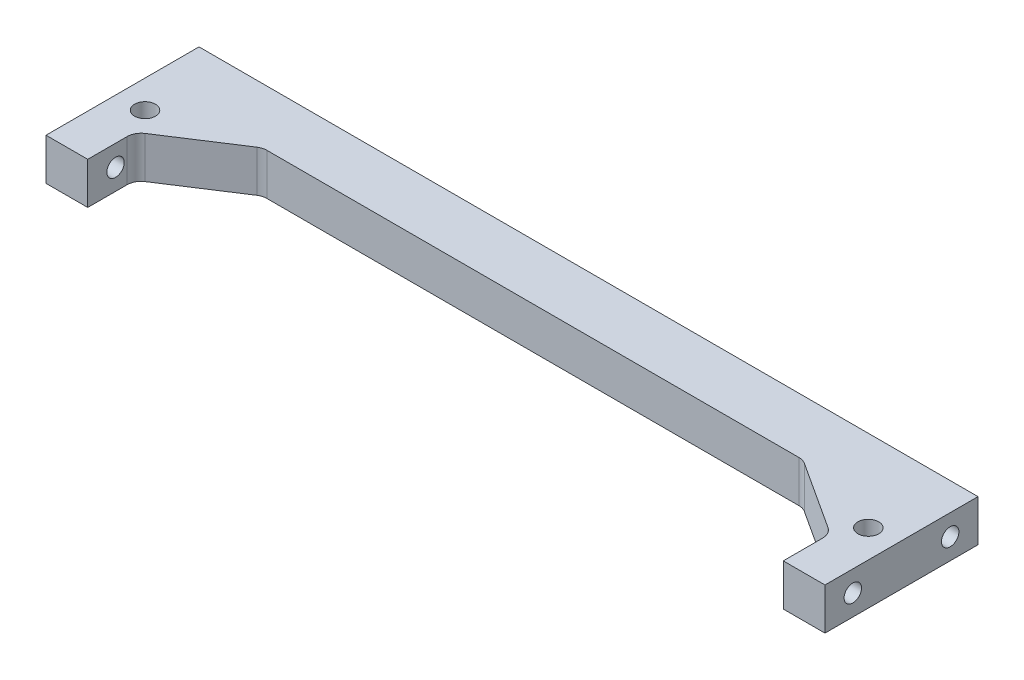
ISO-10303-21;
HEADER;
FILE_DESCRIPTION(('STEP AP214'),'2;1');
FILE_NAME('part.step','',(''),(''),'','','');
FILE_SCHEMA(('AUTOMOTIVE_DESIGN { 1 0 10303 214 1 1 1 1 }'));
ENDSEC;
DATA;
#1=APPLICATION_CONTEXT('core data for automotive mechanical design processes');
#2=APPLICATION_PROTOCOL_DEFINITION('international standard','automotive_design',2000,#1);
#3=PRODUCT_CONTEXT('',#1,'mechanical');
#4=PRODUCT('Part','Part','',(#3));
#5=PRODUCT_RELATED_PRODUCT_CATEGORY('part','',(#4));
#6=PRODUCT_DEFINITION_FORMATION('','',#4);
#7=PRODUCT_DEFINITION_CONTEXT('part definition',#1,'design');
#8=PRODUCT_DEFINITION('design','',#6,#7);
#9=PRODUCT_DEFINITION_SHAPE('','',#8);
#10=(LENGTH_UNIT() NAMED_UNIT(*) SI_UNIT(.MILLI.,.METRE.));
#11=(NAMED_UNIT(*) PLANE_ANGLE_UNIT() SI_UNIT($,.RADIAN.));
#12=(NAMED_UNIT(*) SI_UNIT($,.STERADIAN.) SOLID_ANGLE_UNIT());
#13=UNCERTAINTY_MEASURE_WITH_UNIT(LENGTH_MEASURE(1.E-05),#10,'distance_accuracy_value','');
#14=(GEOMETRIC_REPRESENTATION_CONTEXT(3) GLOBAL_UNCERTAINTY_ASSIGNED_CONTEXT((#13)) GLOBAL_UNIT_ASSIGNED_CONTEXT((#10,
#11,#12)) REPRESENTATION_CONTEXT('',''));
#15=CARTESIAN_POINT('',(0.,0.,0.));
#16=DIRECTION('',(0.,0.,1.));
#17=DIRECTION('',(1.,0.,0.));
#18=AXIS2_PLACEMENT_3D('',#15,#16,#17);
#19=CARTESIAN_POINT('',(0.,6.,0.));
#20=DIRECTION('',(0.,1.,0.));
#21=DIRECTION('',(0.,0.,1.));
#22=AXIS2_PLACEMENT_3D('',#19,#20,#21);
#23=PLANE('',#22);
#24=DIRECTION('',(0.,0.,1.));
#25=VECTOR('',#24,1.);
#26=CARTESIAN_POINT('',(-56.,6.,22.));
#27=LINE('',#26,#25);
#28=CARTESIAN_POINT('',(-56.,6.,22.));
#29=VERTEX_POINT('',#28);
#30=CARTESIAN_POINT('',(-56.,6.,44.));
#31=VERTEX_POINT('',#30);
#32=EDGE_CURVE('E214',#29,#31,#27,.T.);
#33=ORIENTED_EDGE('',*,*,#32,.T.);
#34=DIRECTION('',(1.,0.,0.));
#35=VECTOR('',#34,1.);
#36=CARTESIAN_POINT('',(-56.,6.,44.));
#37=LINE('',#36,#35);
#38=CARTESIAN_POINT('',(-50.,6.,44.));
#39=VERTEX_POINT('',#38);
#40=EDGE_CURVE('E217',#31,#39,#37,.T.);
#41=ORIENTED_EDGE('',*,*,#40,.T.);
#42=DIRECTION('',(0.,0.,-1.));
#43=VECTOR('',#42,1.);
#44=CARTESIAN_POINT('',(-50.,6.,44.));
#45=LINE('',#44,#43);
#46=CARTESIAN_POINT('',(-50.,6.,38.3257442304943));
#47=VERTEX_POINT('',#46);
#48=EDGE_CURVE('E220',#39,#47,#45,.T.);
#49=ORIENTED_EDGE('',*,*,#48,.T.);
#50=CARTESIAN_POINT('',(-48.,6.,38.3257442304943));
#51=DIRECTION('',(0.,1.,0.));
#52=DIRECTION('',(0.,0.,1.));
#53=AXIS2_PLACEMENT_3D('',#50,#51,#52);
#54=CIRCLE('',#53,2.);
#55=CARTESIAN_POINT('',(-49.08927807003,6.,36.6484030946034));
#56=VERTEX_POINT('',#55);
#57=EDGE_CURVE('E264',#47,#56,#54,.F.);
#58=ORIENTED_EDGE('',*,*,#57,.T.);
#59=DIRECTION('',(0.838670567945438,0.,-0.544639035015005));
#60=VECTOR('',#59,1.);
#61=CARTESIAN_POINT('',(-50.,6.,37.2398328312174));
#62=LINE('',#61,#60);
#63=CARTESIAN_POINT('',(-39.348486159439,6.,30.3226588641091));
#64=VERTEX_POINT('',#63);
#65=EDGE_CURVE('E223',#56,#64,#62,.T.);
#66=ORIENTED_EDGE('',*,*,#65,.T.);
#67=CARTESIAN_POINT('',(-38.259208089409,6.,32.));
#68=DIRECTION('',(0.,1.,0.));
#69=DIRECTION('',(0.,0.,1.));
#70=AXIS2_PLACEMENT_3D('',#67,#68,#69);
#71=CIRCLE('',#70,2.);
#72=CARTESIAN_POINT('',(-38.259208089409,6.,30.));
#73=VERTEX_POINT('',#72);
#74=EDGE_CURVE('E268',#64,#73,#71,.F.);
#75=ORIENTED_EDGE('',*,*,#74,.T.);
#76=DIRECTION('',(1.,0.,0.));
#77=VECTOR('',#76,1.);
#78=CARTESIAN_POINT('',(0.,6.,30.));
#79=LINE('',#78,#77);
#80=CARTESIAN_POINT('',(38.259208089409,6.,30.));
#81=VERTEX_POINT('',#80);
#82=EDGE_CURVE('E226',#73,#81,#79,.T.);
#83=ORIENTED_EDGE('',*,*,#82,.T.);
#84=CARTESIAN_POINT('',(38.259208089409,6.,32.));
#85=DIRECTION('',(0.,1.,0.));
#86=DIRECTION('',(0.,0.,1.));
#87=AXIS2_PLACEMENT_3D('',#84,#85,#86);
#88=CIRCLE('',#87,2.);
#89=CARTESIAN_POINT('',(39.348486159439,6.,30.3226588641091));
#90=VERTEX_POINT('',#89);
#91=EDGE_CURVE('E11',#81,#90,#88,.F.);
#92=ORIENTED_EDGE('',*,*,#91,.T.);
#93=DIRECTION('',(-0.838670567945438,0.,-0.544639035015005));
#94=VECTOR('',#93,1.);
#95=CARTESIAN_POINT('',(50.,6.,37.2398328312174));
#96=LINE('',#95,#94);
#97=CARTESIAN_POINT('',(49.08927807003,6.,36.6484030946034));
#98=VERTEX_POINT('',#97);
#99=EDGE_CURVE('E169',#98,#90,#96,.T.);
#100=ORIENTED_EDGE('',*,*,#99,.F.);
#101=CARTESIAN_POINT('',(48.,6.,38.3257442304943));
#102=DIRECTION('',(0.,1.,0.));
#103=DIRECTION('',(0.,0.,1.));
#104=AXIS2_PLACEMENT_3D('',#101,#102,#103);
#105=CIRCLE('',#104,2.);
#106=CARTESIAN_POINT('',(50.,6.,38.3257442304943));
#107=VERTEX_POINT('',#106);
#108=EDGE_CURVE('E281',#98,#107,#105,.F.);
#109=ORIENTED_EDGE('',*,*,#108,.T.);
#110=DIRECTION('',(0.,0.,-1.));
#111=VECTOR('',#110,1.);
#112=CARTESIAN_POINT('',(50.,6.,44.));
#113=LINE('',#112,#111);
#114=CARTESIAN_POINT('',(50.,6.,44.));
#115=VERTEX_POINT('',#114);
#116=EDGE_CURVE('E173',#115,#107,#113,.T.);
#117=ORIENTED_EDGE('',*,*,#116,.F.);
#118=DIRECTION('',(-1.,0.,0.));
#119=VECTOR('',#118,1.);
#120=CARTESIAN_POINT('',(56.,6.,44.));
#121=LINE('',#120,#119);
#122=CARTESIAN_POINT('',(56.,6.,44.));
#123=VERTEX_POINT('',#122);
#124=EDGE_CURVE('E176',#123,#115,#121,.T.);
#125=ORIENTED_EDGE('',*,*,#124,.F.);
#126=DIRECTION('',(0.,0.,1.));
#127=VECTOR('',#126,1.);
#128=CARTESIAN_POINT('',(56.,6.,22.));
#129=LINE('',#128,#127);
#130=CARTESIAN_POINT('',(56.,6.,22.));
#131=VERTEX_POINT('',#130);
#132=EDGE_CURVE('E166',#131,#123,#129,.T.);
#133=ORIENTED_EDGE('',*,*,#132,.F.);
#134=DIRECTION('',(-1.,0.,0.));
#135=VECTOR('',#134,1.);
#136=CARTESIAN_POINT('',(0.,6.,22.));
#137=LINE('',#136,#135);
#138=EDGE_CURVE('E228',#131,#29,#137,.T.);
#139=ORIENTED_EDGE('',*,*,#138,.T.);
#140=EDGE_LOOP('',(#33,#41,#49,#58,#66,#75,#83,#92,#100,#109,#117,#125,#133,#139));
#141=FACE_BOUND('',#140,.T.);
#142=CARTESIAN_POINT('',(-51.9975752126172,6.,33.7676201709303));
#143=DIRECTION('',(0.,1.,0.));
#144=DIRECTION('',(0.,0.,1.));
#145=AXIS2_PLACEMENT_3D('',#142,#143,#144);
#146=CIRCLE('',#145,1.50000000000035);
#147=CARTESIAN_POINT('',(-51.9975752126172,6.,35.2676201709307));
#148=VERTEX_POINT('',#147);
#149=EDGE_CURVE('E208',#148,#148,#146,.T.);
#150=ORIENTED_EDGE('',*,*,#149,.F.);
#151=EDGE_LOOP('',(#150));
#152=FACE_BOUND('',#151,.T.);
#153=CARTESIAN_POINT('',(51.9975752126172,6.,33.7676201709303));
#154=DIRECTION('',(0.,-1.,0.));
#155=DIRECTION('',(0.,0.,1.));
#156=AXIS2_PLACEMENT_3D('',#153,#154,#155);
#157=CIRCLE('',#156,1.50000000000035);
#158=CARTESIAN_POINT('',(51.9975752126172,6.,35.2676201709307));
#159=VERTEX_POINT('',#158);
#160=EDGE_CURVE('E160',#159,#159,#157,.T.);
#161=ORIENTED_EDGE('',*,*,#160,.T.);
#162=EDGE_LOOP('',(#161));
#163=FACE_BOUND('',#162,.T.);
#164=ADVANCED_FACE('F33',(#141,#152,#163),#23,.T.);
#165=CARTESIAN_POINT('',(0.,0.,0.));
#166=DIRECTION('',(0.,1.,0.));
#167=DIRECTION('',(0.,0.,1.));
#168=AXIS2_PLACEMENT_3D('',#165,#166,#167);
#169=PLANE('',#168);
#170=DIRECTION('',(0.,0.,1.));
#171=VECTOR('',#170,1.);
#172=CARTESIAN_POINT('',(-56.,0.,22.));
#173=LINE('',#172,#171);
#174=CARTESIAN_POINT('',(-56.,0.,22.));
#175=VERTEX_POINT('',#174);
#176=CARTESIAN_POINT('',(-56.,0.,44.));
#177=VERTEX_POINT('',#176);
#178=EDGE_CURVE('E211',#175,#177,#173,.T.);
#179=ORIENTED_EDGE('',*,*,#178,.F.);
#180=DIRECTION('',(-1.,0.,0.));
#181=VECTOR('',#180,1.);
#182=CARTESIAN_POINT('',(0.,0.,22.));
#183=LINE('',#182,#181);
#184=CARTESIAN_POINT('',(56.,0.,22.));
#185=VERTEX_POINT('',#184);
#186=EDGE_CURVE('E218',#185,#175,#183,.T.);
#187=ORIENTED_EDGE('',*,*,#186,.F.);
#188=DIRECTION('',(0.,0.,1.));
#189=VECTOR('',#188,1.);
#190=CARTESIAN_POINT('',(56.,0.,22.));
#191=LINE('',#190,#189);
#192=CARTESIAN_POINT('',(56.,0.,44.));
#193=VERTEX_POINT('',#192);
#194=EDGE_CURVE('E163',#185,#193,#191,.T.);
#195=ORIENTED_EDGE('',*,*,#194,.T.);
#196=DIRECTION('',(-1.,0.,0.));
#197=VECTOR('',#196,1.);
#198=CARTESIAN_POINT('',(56.,0.,44.));
#199=LINE('',#198,#197);
#200=CARTESIAN_POINT('',(50.,0.,44.));
#201=VERTEX_POINT('',#200);
#202=EDGE_CURVE('E170',#193,#201,#199,.T.);
#203=ORIENTED_EDGE('',*,*,#202,.T.);
#204=DIRECTION('',(0.,0.,-1.));
#205=VECTOR('',#204,1.);
#206=CARTESIAN_POINT('',(50.,0.,44.));
#207=LINE('',#206,#205);
#208=CARTESIAN_POINT('',(50.,0.,38.3257442304943));
#209=VERTEX_POINT('',#208);
#210=EDGE_CURVE('E184',#201,#209,#207,.T.);
#211=ORIENTED_EDGE('',*,*,#210,.T.);
#212=CARTESIAN_POINT('',(48.,0.,38.3257442304943));
#213=DIRECTION('',(0.,1.,0.));
#214=DIRECTION('',(0.,0.,1.));
#215=AXIS2_PLACEMENT_3D('',#212,#213,#214);
#216=CIRCLE('',#215,2.);
#217=CARTESIAN_POINT('',(49.08927807003,0.,36.6484030946034));
#218=VERTEX_POINT('',#217);
#219=EDGE_CURVE('E279',#209,#218,#216,.T.);
#220=ORIENTED_EDGE('',*,*,#219,.T.);
#221=DIRECTION('',(-0.838670567945438,0.,-0.544639035015005));
#222=VECTOR('',#221,1.);
#223=CARTESIAN_POINT('',(50.,0.,37.2398328312174));
#224=LINE('',#223,#222);
#225=CARTESIAN_POINT('',(39.348486159439,0.,30.3226588641091));
#226=VERTEX_POINT('',#225);
#227=EDGE_CURVE('E182',#218,#226,#224,.T.);
#228=ORIENTED_EDGE('',*,*,#227,.T.);
#229=CARTESIAN_POINT('',(38.259208089409,0.,32.));
#230=DIRECTION('',(0.,1.,0.));
#231=DIRECTION('',(0.,0.,1.));
#232=AXIS2_PLACEMENT_3D('',#229,#230,#231);
#233=CIRCLE('',#232,2.);
#234=CARTESIAN_POINT('',(38.259208089409,0.,30.));
#235=VERTEX_POINT('',#234);
#236=EDGE_CURVE('E41',#226,#235,#233,.T.);
#237=ORIENTED_EDGE('',*,*,#236,.T.);
#238=DIRECTION('',(1.,0.,0.));
#239=VECTOR('',#238,1.);
#240=CARTESIAN_POINT('',(0.,0.,30.));
#241=LINE('',#240,#239);
#242=CARTESIAN_POINT('',(-38.259208089409,0.,30.));
#243=VERTEX_POINT('',#242);
#244=EDGE_CURVE('E241',#243,#235,#241,.T.);
#245=ORIENTED_EDGE('',*,*,#244,.F.);
#246=CARTESIAN_POINT('',(-38.259208089409,0.,32.));
#247=DIRECTION('',(0.,1.,0.));
#248=DIRECTION('',(0.,0.,1.));
#249=AXIS2_PLACEMENT_3D('',#246,#247,#248);
#250=CIRCLE('',#249,2.);
#251=CARTESIAN_POINT('',(-39.348486159439,0.,30.3226588641091));
#252=VERTEX_POINT('',#251);
#253=EDGE_CURVE('E266',#243,#252,#250,.T.);
#254=ORIENTED_EDGE('',*,*,#253,.T.);
#255=DIRECTION('',(0.838670567945438,0.,-0.544639035015005));
#256=VECTOR('',#255,1.);
#257=CARTESIAN_POINT('',(-50.,0.,37.2398328312174));
#258=LINE('',#257,#256);
#259=CARTESIAN_POINT('',(-49.08927807003,0.,36.6484030946034));
#260=VERTEX_POINT('',#259);
#261=EDGE_CURVE('E238',#260,#252,#258,.T.);
#262=ORIENTED_EDGE('',*,*,#261,.F.);
#263=CARTESIAN_POINT('',(-48.,0.,38.3257442304943));
#264=DIRECTION('',(0.,1.,0.));
#265=DIRECTION('',(0.,0.,1.));
#266=AXIS2_PLACEMENT_3D('',#263,#264,#265);
#267=CIRCLE('',#266,2.);
#268=CARTESIAN_POINT('',(-50.,0.,38.3257442304943));
#269=VERTEX_POINT('',#268);
#270=EDGE_CURVE('E262',#260,#269,#267,.T.);
#271=ORIENTED_EDGE('',*,*,#270,.T.);
#272=DIRECTION('',(0.,0.,-1.));
#273=VECTOR('',#272,1.);
#274=CARTESIAN_POINT('',(-50.,0.,44.));
#275=LINE('',#274,#273);
#276=CARTESIAN_POINT('',(-50.,0.,44.));
#277=VERTEX_POINT('',#276);
#278=EDGE_CURVE('E235',#277,#269,#275,.T.);
#279=ORIENTED_EDGE('',*,*,#278,.F.);
#280=DIRECTION('',(1.,0.,0.));
#281=VECTOR('',#280,1.);
#282=CARTESIAN_POINT('',(-56.,0.,44.));
#283=LINE('',#282,#281);
#284=EDGE_CURVE('E233',#177,#277,#283,.T.);
#285=ORIENTED_EDGE('',*,*,#284,.F.);
#286=EDGE_LOOP('',(#179,#187,#195,#203,#211,#220,#228,#237,#245,#254,#262,#271,#279,#285));
#287=FACE_BOUND('',#286,.T.);
#288=CARTESIAN_POINT('',(-51.9975752126172,0.,33.7676201709303));
#289=DIRECTION('',(0.,1.,0.));
#290=DIRECTION('',(0.,0.,1.));
#291=AXIS2_PLACEMENT_3D('',#288,#289,#290);
#292=CIRCLE('',#291,1.50000000000035);
#293=CARTESIAN_POINT('',(-51.9975752126172,0.,35.2676201709307));
#294=VERTEX_POINT('',#293);
#295=EDGE_CURVE('E207',#294,#294,#292,.T.);
#296=ORIENTED_EDGE('',*,*,#295,.T.);
#297=EDGE_LOOP('',(#296));
#298=FACE_BOUND('',#297,.T.);
#299=CARTESIAN_POINT('',(51.9975752126172,0.,33.7676201709303));
#300=DIRECTION('',(0.,-1.,0.));
#301=DIRECTION('',(0.,0.,1.));
#302=AXIS2_PLACEMENT_3D('',#299,#300,#301);
#303=CIRCLE('',#302,1.50000000000035);
#304=CARTESIAN_POINT('',(51.9975752126172,0.,35.2676201709307));
#305=VERTEX_POINT('',#304);
#306=EDGE_CURVE('E159',#305,#305,#303,.T.);
#307=ORIENTED_EDGE('',*,*,#306,.F.);
#308=EDGE_LOOP('',(#307));
#309=FACE_BOUND('',#308,.T.);
#310=ADVANCED_FACE('F297',(#287,#298,#309),#169,.F.);
#311=CARTESIAN_POINT('',(-56.,6.,22.));
#312=DIRECTION('',(1.,0.,0.));
#313=DIRECTION('',(0.,0.,-1.));
#314=AXIS2_PLACEMENT_3D('',#311,#312,#313);
#315=PLANE('',#314);
#316=CARTESIAN_POINT('',(-56.,3.,26.));
#317=DIRECTION('',(-1.,0.,0.));
#318=DIRECTION('',(0.,0.,1.));
#319=AXIS2_PLACEMENT_3D('',#316,#317,#318);
#320=CIRCLE('',#319,1.24999999999999);
#321=CARTESIAN_POINT('',(-56.,3.,27.25));
#322=VERTEX_POINT('',#321);
#323=EDGE_CURVE('E195',#322,#322,#320,.T.);
#324=ORIENTED_EDGE('',*,*,#323,.F.);
#325=EDGE_LOOP('',(#324));
#326=FACE_BOUND('',#325,.T.);
#327=CARTESIAN_POINT('',(-56.,3.,40.));
#328=DIRECTION('',(-1.,0.,0.));
#329=DIRECTION('',(0.,0.,1.));
#330=AXIS2_PLACEMENT_3D('',#327,#328,#329);
#331=CIRCLE('',#330,1.24999999999999);
#332=CARTESIAN_POINT('',(-56.,3.,41.25));
#333=VERTEX_POINT('',#332);
#334=EDGE_CURVE('E201',#333,#333,#331,.T.);
#335=ORIENTED_EDGE('',*,*,#334,.F.);
#336=EDGE_LOOP('',(#335));
#337=FACE_BOUND('',#336,.T.);
#338=ORIENTED_EDGE('',*,*,#178,.T.);
#339=DIRECTION('',(0.,-1.,0.));
#340=VECTOR('',#339,1.);
#341=CARTESIAN_POINT('',(-56.,6.,44.));
#342=LINE('',#341,#340);
#343=EDGE_CURVE('E249',#31,#177,#342,.T.);
#344=ORIENTED_EDGE('',*,*,#343,.F.);
#345=ORIENTED_EDGE('',*,*,#32,.F.);
#346=DIRECTION('',(0.,-1.,0.));
#347=VECTOR('',#346,1.);
#348=CARTESIAN_POINT('',(-56.,6.,22.));
#349=LINE('',#348,#347);
#350=EDGE_CURVE('E230',#29,#175,#349,.T.);
#351=ORIENTED_EDGE('',*,*,#350,.T.);
#352=EDGE_LOOP('',(#338,#344,#345,#351));
#353=FACE_BOUND('',#352,.T.);
#354=ADVANCED_FACE('F328',(#326,#337,#353),#315,.F.);
#355=CARTESIAN_POINT('',(-56.,6.,44.));
#356=DIRECTION('',(0.,0.,-1.));
#357=DIRECTION('',(-1.,0.,0.));
#358=AXIS2_PLACEMENT_3D('',#355,#356,#357);
#359=PLANE('',#358);
#360=ORIENTED_EDGE('',*,*,#284,.T.);
#361=DIRECTION('',(0.,-1.,0.));
#362=VECTOR('',#361,1.);
#363=CARTESIAN_POINT('',(-50.,6.,44.));
#364=LINE('',#363,#362);
#365=EDGE_CURVE('E246',#39,#277,#364,.T.);
#366=ORIENTED_EDGE('',*,*,#365,.F.);
#367=ORIENTED_EDGE('',*,*,#40,.F.);
#368=ORIENTED_EDGE('',*,*,#343,.T.);
#369=EDGE_LOOP('',(#360,#366,#367,#368));
#370=FACE_BOUND('',#369,.T.);
#371=ADVANCED_FACE('F325',(#370),#359,.F.);
#372=CARTESIAN_POINT('',(-50.,6.,44.));
#373=DIRECTION('',(-1.,0.,0.));
#374=DIRECTION('',(0.,0.,1.));
#375=AXIS2_PLACEMENT_3D('',#372,#373,#374);
#376=PLANE('',#375);
#377=CARTESIAN_POINT('',(-50.,3.,40.));
#378=DIRECTION('',(-1.,0.,0.));
#379=DIRECTION('',(0.,0.,1.));
#380=AXIS2_PLACEMENT_3D('',#377,#378,#379);
#381=CIRCLE('',#380,1.24999999999999);
#382=CARTESIAN_POINT('',(-50.,3.,41.25));
#383=VERTEX_POINT('',#382);
#384=EDGE_CURVE('E204',#383,#383,#381,.T.);
#385=ORIENTED_EDGE('',*,*,#384,.T.);
#386=EDGE_LOOP('',(#385));
#387=FACE_BOUND('',#386,.T.);
#388=ORIENTED_EDGE('',*,*,#278,.T.);
#389=DIRECTION('',(0.,-1.,0.));
#390=VECTOR('',#389,1.);
#391=CARTESIAN_POINT('',(-50.,6.,38.3257442304943));
#392=LINE('',#391,#390);
#393=EDGE_CURVE('E257',#269,#47,#392,.F.);
#394=ORIENTED_EDGE('',*,*,#393,.T.);
#395=ORIENTED_EDGE('',*,*,#48,.F.);
#396=ORIENTED_EDGE('',*,*,#365,.T.);
#397=EDGE_LOOP('',(#388,#394,#395,#396));
#398=FACE_BOUND('',#397,.T.);
#399=ADVANCED_FACE('F321',(#387,#398),#376,.F.);
#400=CARTESIAN_POINT('',(-50.,6.,37.2398328312174));
#401=DIRECTION('',(-0.544639035015005,0.,-0.838670567945438));
#402=DIRECTION('',(-0.838670567945438,0.,0.544639035015005));
#403=AXIS2_PLACEMENT_3D('',#400,#401,#402);
#404=PLANE('',#403);
#405=ORIENTED_EDGE('',*,*,#65,.F.);
#406=DIRECTION('',(0.,-1.,0.));
#407=VECTOR('',#406,1.);
#408=CARTESIAN_POINT('',(-49.08927807003,0.,36.6484030946034));
#409=LINE('',#408,#407);
#410=EDGE_CURVE('E254',#56,#260,#409,.T.);
#411=ORIENTED_EDGE('',*,*,#410,.T.);
#412=ORIENTED_EDGE('',*,*,#261,.T.);
#413=DIRECTION('',(0.,-1.,0.));
#414=VECTOR('',#413,1.);
#415=CARTESIAN_POINT('',(-39.348486159439,6.,30.3226588641091));
#416=LINE('',#415,#414);
#417=EDGE_CURVE('E252',#252,#64,#416,.F.);
#418=ORIENTED_EDGE('',*,*,#417,.T.);
#419=EDGE_LOOP('',(#405,#411,#412,#418));
#420=FACE_BOUND('',#419,.T.);
#421=ADVANCED_FACE('F313',(#420),#404,.F.);
#422=CARTESIAN_POINT('',(0.,6.,30.));
#423=DIRECTION('',(0.,0.,-1.));
#424=DIRECTION('',(-1.,0.,0.));
#425=AXIS2_PLACEMENT_3D('',#422,#423,#424);
#426=PLANE('',#425);
#427=ORIENTED_EDGE('',*,*,#244,.T.);
#428=DIRECTION('',(0.,-1.,0.));
#429=VECTOR('',#428,1.);
#430=CARTESIAN_POINT('',(38.259208089409,6.,30.));
#431=LINE('',#430,#429);
#432=EDGE_CURVE('E54',#235,#81,#431,.F.);
#433=ORIENTED_EDGE('',*,*,#432,.T.);
#434=ORIENTED_EDGE('',*,*,#82,.F.);
#435=DIRECTION('',(0.,-1.,0.));
#436=VECTOR('',#435,1.);
#437=CARTESIAN_POINT('',(-38.259208089409,0.,30.));
#438=LINE('',#437,#436);
#439=EDGE_CURVE('E259',#73,#243,#438,.T.);
#440=ORIENTED_EDGE('',*,*,#439,.T.);
#441=EDGE_LOOP('',(#427,#433,#434,#440));
#442=FACE_BOUND('',#441,.T.);
#443=ADVANCED_FACE('F306',(#442),#426,.F.);
#444=CARTESIAN_POINT('',(0.,6.,22.));
#445=DIRECTION('',(0.,0.,1.));
#446=DIRECTION('',(1.,0.,0.));
#447=AXIS2_PLACEMENT_3D('',#444,#445,#446);
#448=PLANE('',#447);
#449=ORIENTED_EDGE('',*,*,#186,.T.);
#450=ORIENTED_EDGE('',*,*,#350,.F.);
#451=ORIENTED_EDGE('',*,*,#138,.F.);
#452=DIRECTION('',(0.,-1.,0.));
#453=VECTOR('',#452,1.);
#454=CARTESIAN_POINT('',(56.,6.,22.));
#455=LINE('',#454,#453);
#456=EDGE_CURVE('E192',#131,#185,#455,.T.);
#457=ORIENTED_EDGE('',*,*,#456,.T.);
#458=EDGE_LOOP('',(#449,#450,#451,#457));
#459=FACE_BOUND('',#458,.T.);
#460=ADVANCED_FACE('F332',(#459),#448,.F.);
#461=CARTESIAN_POINT('',(-51.9975752126172,6.,33.7676201709303));
#462=DIRECTION('',(0.,-1.,0.));
#463=DIRECTION('',(0.,0.,-1.));
#464=AXIS2_PLACEMENT_3D('',#461,#462,#463);
#465=CYLINDRICAL_SURFACE('',#464,1.50000000000035);
#466=ORIENTED_EDGE('',*,*,#149,.T.);
#467=EDGE_LOOP('',(#466));
#468=FACE_BOUND('',#467,.T.);
#469=ORIENTED_EDGE('',*,*,#295,.F.);
#470=EDGE_LOOP('',(#469));
#471=FACE_BOUND('',#470,.T.);
#472=ADVANCED_FACE('F359',(#468,#471),#465,.F.);
#473=CARTESIAN_POINT('',(-48.,6.,38.3257442304943));
#474=DIRECTION('',(0.,1.,0.));
#475=DIRECTION('',(0.,0.,1.));
#476=AXIS2_PLACEMENT_3D('',#473,#474,#475);
#477=CYLINDRICAL_SURFACE('',#476,2.);
#478=ORIENTED_EDGE('',*,*,#57,.F.);
#479=ORIENTED_EDGE('',*,*,#393,.F.);
#480=ORIENTED_EDGE('',*,*,#270,.F.);
#481=ORIENTED_EDGE('',*,*,#410,.F.);
#482=EDGE_LOOP('',(#478,#479,#480,#481));
#483=FACE_BOUND('',#482,.T.);
#484=ADVANCED_FACE('F317',(#483),#477,.F.);
#485=CARTESIAN_POINT('',(-38.259208089409,6.,32.));
#486=DIRECTION('',(0.,1.,0.));
#487=DIRECTION('',(0.,0.,1.));
#488=AXIS2_PLACEMENT_3D('',#485,#486,#487);
#489=CYLINDRICAL_SURFACE('',#488,2.);
#490=ORIENTED_EDGE('',*,*,#74,.F.);
#491=ORIENTED_EDGE('',*,*,#417,.F.);
#492=ORIENTED_EDGE('',*,*,#253,.F.);
#493=ORIENTED_EDGE('',*,*,#439,.F.);
#494=EDGE_LOOP('',(#490,#491,#492,#493));
#495=FACE_BOUND('',#494,.T.);
#496=ADVANCED_FACE('F308',(#495),#489,.F.);
#497=CARTESIAN_POINT('',(-56.,3.,40.));
#498=DIRECTION('',(-1.,0.,0.));
#499=DIRECTION('',(0.,0.,1.));
#500=AXIS2_PLACEMENT_3D('',#497,#498,#499);
#501=CYLINDRICAL_SURFACE('',#500,1.24999999999999);
#502=ORIENTED_EDGE('',*,*,#334,.T.);
#503=EDGE_LOOP('',(#502));
#504=FACE_BOUND('',#503,.T.);
#505=ORIENTED_EDGE('',*,*,#384,.F.);
#506=EDGE_LOOP('',(#505));
#507=FACE_BOUND('',#506,.T.);
#508=ADVANCED_FACE('F379',(#504,#507),#501,.F.);
#509=CARTESIAN_POINT('',(-46.,3.,26.));
#510=DIRECTION('',(-1.,0.,0.));
#511=DIRECTION('',(0.,0.,1.));
#512=AXIS2_PLACEMENT_3D('',#509,#510,#511);
#513=CONICAL_SURFACE('',#512,1.24999999999999,1.02974425867665);
#514=CARTESIAN_POINT('',(-45.2489242262155,3.,26.));
#515=VERTEX_POINT('',#514);
#516=VERTEX_LOOP('',#515);
#517=FACE_BOUND('',#516,.T.);
#518=CARTESIAN_POINT('',(-46.,3.,26.));
#519=DIRECTION('',(-1.,0.,0.));
#520=DIRECTION('',(0.,0.,1.));
#521=AXIS2_PLACEMENT_3D('',#518,#519,#520);
#522=CIRCLE('',#521,1.24999999999999);
#523=CARTESIAN_POINT('',(-46.,3.,27.25));
#524=VERTEX_POINT('',#523);
#525=EDGE_CURVE('E198',#524,#524,#522,.T.);
#526=ORIENTED_EDGE('',*,*,#525,.T.);
#527=EDGE_LOOP('',(#526));
#528=FACE_BOUND('',#527,.T.);
#529=ADVANCED_FACE('F409',(#517,#528),#513,.F.);
#530=CARTESIAN_POINT('',(-56.,3.,26.));
#531=DIRECTION('',(-1.,0.,0.));
#532=DIRECTION('',(0.,0.,1.));
#533=AXIS2_PLACEMENT_3D('',#530,#531,#532);
#534=CYLINDRICAL_SURFACE('',#533,1.24999999999999);
#535=ORIENTED_EDGE('',*,*,#525,.F.);
#536=EDGE_LOOP('',(#535));
#537=FACE_BOUND('',#536,.T.);
#538=ORIENTED_EDGE('',*,*,#323,.T.);
#539=EDGE_LOOP('',(#538));
#540=FACE_BOUND('',#539,.T.);
#541=ADVANCED_FACE('F401',(#537,#540),#534,.F.);
#542=CARTESIAN_POINT('',(56.,6.,22.));
#543=DIRECTION('',(1.,0.,0.));
#544=DIRECTION('',(0.,0.,-1.));
#545=AXIS2_PLACEMENT_3D('',#542,#543,#544);
#546=PLANE('',#545);
#547=CARTESIAN_POINT('',(56.,3.,26.));
#548=DIRECTION('',(1.,0.,0.));
#549=DIRECTION('',(0.,0.,-1.));
#550=AXIS2_PLACEMENT_3D('',#547,#548,#549);
#551=CIRCLE('',#550,1.24999999999999);
#552=CARTESIAN_POINT('',(56.,3.,24.75));
#553=VERTEX_POINT('',#552);
#554=EDGE_CURVE('E149',#553,#553,#551,.T.);
#555=ORIENTED_EDGE('',*,*,#554,.F.);
#556=EDGE_LOOP('',(#555));
#557=FACE_BOUND('',#556,.T.);
#558=CARTESIAN_POINT('',(56.,3.,40.));
#559=DIRECTION('',(1.,0.,0.));
#560=DIRECTION('',(0.,0.,-1.));
#561=AXIS2_PLACEMENT_3D('',#558,#559,#560);
#562=CIRCLE('',#561,1.24999999999999);
#563=CARTESIAN_POINT('',(56.,3.,38.75));
#564=VERTEX_POINT('',#563);
#565=EDGE_CURVE('E148',#564,#564,#562,.T.);
#566=ORIENTED_EDGE('',*,*,#565,.F.);
#567=EDGE_LOOP('',(#566));
#568=FACE_BOUND('',#567,.T.);
#569=ORIENTED_EDGE('',*,*,#194,.F.);
#570=ORIENTED_EDGE('',*,*,#456,.F.);
#571=ORIENTED_EDGE('',*,*,#132,.T.);
#572=DIRECTION('',(0.,-1.,0.));
#573=VECTOR('',#572,1.);
#574=CARTESIAN_POINT('',(56.,6.,44.));
#575=LINE('',#574,#573);
#576=EDGE_CURVE('E179',#123,#193,#575,.T.);
#577=ORIENTED_EDGE('',*,*,#576,.T.);
#578=EDGE_LOOP('',(#569,#570,#571,#577));
#579=FACE_BOUND('',#578,.T.);
#580=ADVANCED_FACE('F337',(#557,#568,#579),#546,.T.);
#581=CARTESIAN_POINT('',(50.,6.,37.2398328312174));
#582=DIRECTION('',(-0.544639035015005,0.,0.838670567945438));
#583=DIRECTION('',(0.838670567945438,0.,0.544639035015005));
#584=AXIS2_PLACEMENT_3D('',#581,#582,#583);
#585=PLANE('',#584);
#586=ORIENTED_EDGE('',*,*,#227,.F.);
#587=DIRECTION('',(0.,-1.,0.));
#588=VECTOR('',#587,1.);
#589=CARTESIAN_POINT('',(49.08927807003,6.,36.6484030946034));
#590=LINE('',#589,#588);
#591=EDGE_CURVE('E276',#218,#98,#590,.F.);
#592=ORIENTED_EDGE('',*,*,#591,.T.);
#593=ORIENTED_EDGE('',*,*,#99,.T.);
#594=DIRECTION('',(0.,-1.,0.));
#595=VECTOR('',#594,1.);
#596=CARTESIAN_POINT('',(39.348486159439,6.,30.3226588641091));
#597=LINE('',#596,#595);
#598=EDGE_CURVE('E273',#90,#226,#597,.T.);
#599=ORIENTED_EDGE('',*,*,#598,.T.);
#600=EDGE_LOOP('',(#586,#592,#593,#599));
#601=FACE_BOUND('',#600,.T.);
#602=ADVANCED_FACE('F300',(#601),#585,.T.);
#603=CARTESIAN_POINT('',(50.,6.,44.));
#604=DIRECTION('',(-1.,0.,0.));
#605=DIRECTION('',(0.,0.,1.));
#606=AXIS2_PLACEMENT_3D('',#603,#604,#605);
#607=PLANE('',#606);
#608=CARTESIAN_POINT('',(50.,3.,40.));
#609=DIRECTION('',(-1.,0.,0.));
#610=DIRECTION('',(0.,0.,1.));
#611=AXIS2_PLACEMENT_3D('',#608,#609,#610);
#612=CIRCLE('',#611,1.24999999999999);
#613=CARTESIAN_POINT('',(50.,3.,41.25));
#614=VERTEX_POINT('',#613);
#615=EDGE_CURVE('E152',#614,#614,#612,.T.);
#616=ORIENTED_EDGE('',*,*,#615,.F.);
#617=EDGE_LOOP('',(#616));
#618=FACE_BOUND('',#617,.T.);
#619=ORIENTED_EDGE('',*,*,#116,.T.);
#620=DIRECTION('',(0.,-1.,0.));
#621=VECTOR('',#620,1.);
#622=CARTESIAN_POINT('',(50.,0.,38.3257442304943));
#623=LINE('',#622,#621);
#624=EDGE_CURVE('E270',#107,#209,#623,.T.);
#625=ORIENTED_EDGE('',*,*,#624,.T.);
#626=ORIENTED_EDGE('',*,*,#210,.F.);
#627=DIRECTION('',(0.,-1.,0.));
#628=VECTOR('',#627,1.);
#629=CARTESIAN_POINT('',(50.,6.,44.));
#630=LINE('',#629,#628);
#631=EDGE_CURVE('E190',#115,#201,#630,.T.);
#632=ORIENTED_EDGE('',*,*,#631,.F.);
#633=EDGE_LOOP('',(#619,#625,#626,#632));
#634=FACE_BOUND('',#633,.T.);
#635=ADVANCED_FACE('F292',(#618,#634),#607,.T.);
#636=CARTESIAN_POINT('',(56.,6.,44.));
#637=DIRECTION('',(0.,0.,1.));
#638=DIRECTION('',(1.,0.,0.));
#639=AXIS2_PLACEMENT_3D('',#636,#637,#638);
#640=PLANE('',#639);
#641=ORIENTED_EDGE('',*,*,#202,.F.);
#642=ORIENTED_EDGE('',*,*,#576,.F.);
#643=ORIENTED_EDGE('',*,*,#124,.T.);
#644=ORIENTED_EDGE('',*,*,#631,.T.);
#645=EDGE_LOOP('',(#641,#642,#643,#644));
#646=FACE_BOUND('',#645,.T.);
#647=ADVANCED_FACE('F340',(#646),#640,.T.);
#648=CARTESIAN_POINT('',(51.9975752126172,6.,33.7676201709303));
#649=DIRECTION('',(0.,-1.,0.));
#650=DIRECTION('',(0.,0.,-1.));
#651=AXIS2_PLACEMENT_3D('',#648,#649,#650);
#652=CYLINDRICAL_SURFACE('',#651,1.50000000000035);
#653=ORIENTED_EDGE('',*,*,#160,.F.);
#654=EDGE_LOOP('',(#653));
#655=FACE_BOUND('',#654,.T.);
#656=ORIENTED_EDGE('',*,*,#306,.T.);
#657=EDGE_LOOP('',(#656));
#658=FACE_BOUND('',#657,.T.);
#659=ADVANCED_FACE('F342',(#655,#658),#652,.F.);
#660=CARTESIAN_POINT('',(48.,6.,38.3257442304943));
#661=DIRECTION('',(0.,1.,0.));
#662=DIRECTION('',(0.,0.,1.));
#663=AXIS2_PLACEMENT_3D('',#660,#661,#662);
#664=CYLINDRICAL_SURFACE('',#663,2.);
#665=ORIENTED_EDGE('',*,*,#108,.F.);
#666=ORIENTED_EDGE('',*,*,#591,.F.);
#667=ORIENTED_EDGE('',*,*,#219,.F.);
#668=ORIENTED_EDGE('',*,*,#624,.F.);
#669=EDGE_LOOP('',(#665,#666,#667,#668));
#670=FACE_BOUND('',#669,.T.);
#671=ADVANCED_FACE('F294',(#670),#664,.F.);
#672=CARTESIAN_POINT('',(38.259208089409,6.,32.));
#673=DIRECTION('',(0.,-1.,0.));
#674=DIRECTION('',(0.,0.,-1.));
#675=AXIS2_PLACEMENT_3D('',#672,#673,#674);
#676=CYLINDRICAL_SURFACE('',#675,2.);
#677=ORIENTED_EDGE('',*,*,#91,.F.);
#678=ORIENTED_EDGE('',*,*,#432,.F.);
#679=ORIENTED_EDGE('',*,*,#236,.F.);
#680=ORIENTED_EDGE('',*,*,#598,.F.);
#681=EDGE_LOOP('',(#677,#678,#679,#680));
#682=FACE_BOUND('',#681,.T.);
#683=ADVANCED_FACE('F35',(#682),#676,.F.);
#684=CARTESIAN_POINT('',(56.,3.,40.));
#685=DIRECTION('',(1.,0.,0.));
#686=DIRECTION('',(0.,0.,-1.));
#687=AXIS2_PLACEMENT_3D('',#684,#685,#686);
#688=CYLINDRICAL_SURFACE('',#687,1.24999999999999);
#689=ORIENTED_EDGE('',*,*,#615,.T.);
#690=EDGE_LOOP('',(#689));
#691=FACE_BOUND('',#690,.T.);
#692=ORIENTED_EDGE('',*,*,#565,.T.);
#693=EDGE_LOOP('',(#692));
#694=FACE_BOUND('',#693,.T.);
#695=ADVANCED_FACE('F142',(#691,#694),#688,.F.);
#696=CARTESIAN_POINT('',(46.,3.,26.));
#697=DIRECTION('',(1.,0.,0.));
#698=DIRECTION('',(0.,0.,-1.));
#699=AXIS2_PLACEMENT_3D('',#696,#697,#698);
#700=CONICAL_SURFACE('',#699,1.24999999999999,1.02974425867665);
#701=CARTESIAN_POINT('',(45.2489242262155,3.,26.));
#702=VERTEX_POINT('',#701);
#703=VERTEX_LOOP('',#702);
#704=FACE_BOUND('',#703,.T.);
#705=CARTESIAN_POINT('',(46.,3.,26.));
#706=DIRECTION('',(1.,0.,0.));
#707=DIRECTION('',(0.,0.,-1.));
#708=AXIS2_PLACEMENT_3D('',#705,#706,#707);
#709=CIRCLE('',#708,1.24999999999999);
#710=CARTESIAN_POINT('',(46.,3.,24.75));
#711=VERTEX_POINT('',#710);
#712=EDGE_CURVE('E146',#711,#711,#709,.T.);
#713=ORIENTED_EDGE('',*,*,#712,.T.);
#714=EDGE_LOOP('',(#713));
#715=FACE_BOUND('',#714,.T.);
#716=ADVANCED_FACE('F138',(#704,#715),#700,.F.);
#717=CARTESIAN_POINT('',(56.,3.,26.));
#718=DIRECTION('',(1.,0.,0.));
#719=DIRECTION('',(0.,0.,-1.));
#720=AXIS2_PLACEMENT_3D('',#717,#718,#719);
#721=CYLINDRICAL_SURFACE('',#720,1.24999999999999);
#722=ORIENTED_EDGE('',*,*,#712,.F.);
#723=EDGE_LOOP('',(#722));
#724=FACE_BOUND('',#723,.T.);
#725=ORIENTED_EDGE('',*,*,#554,.T.);
#726=EDGE_LOOP('',(#725));
#727=FACE_BOUND('',#726,.T.);
#728=ADVANCED_FACE('F141',(#724,#727),#721,.F.);
#729=CLOSED_SHELL('',(#164,#310,#354,#371,#399,#421,#443,#460,#472,#484,#496,#508,#529,#541,
#580,#602,#635,#647,#659,#671,#683,#695,#716,#728));
#730=MANIFOLD_SOLID_BREP('B2',#729);
#731=ADVANCED_BREP_SHAPE_REPRESENTATION('',(#18,#730),#14);
#732=SHAPE_DEFINITION_REPRESENTATION(#9,#731);
ENDSEC;
END-ISO-10303-21;
